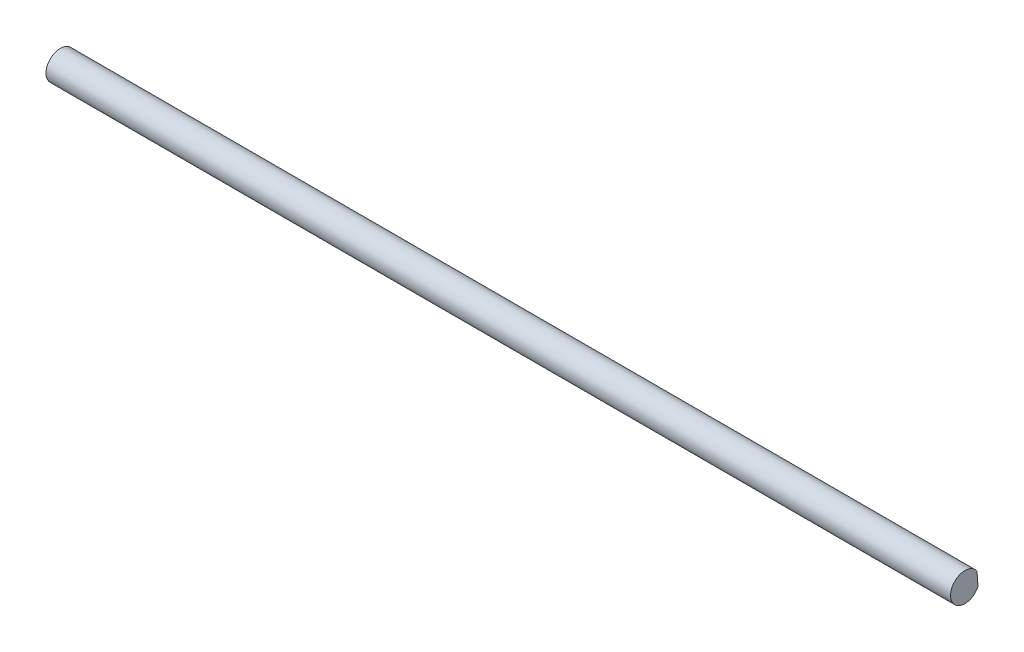
ISO-10303-21;
HEADER;
FILE_DESCRIPTION(('STEP AP214'),'2;1');
FILE_NAME('part.step','',(''),(''),'','','');
FILE_SCHEMA(('AUTOMOTIVE_DESIGN { 1 0 10303 214 1 1 1 1 }'));
ENDSEC;
DATA;
#1=APPLICATION_CONTEXT('core data for automotive mechanical design processes');
#2=APPLICATION_PROTOCOL_DEFINITION('international standard','automotive_design',2000,#1);
#3=PRODUCT_CONTEXT('',#1,'mechanical');
#4=PRODUCT('Part','Part','',(#3));
#5=PRODUCT_RELATED_PRODUCT_CATEGORY('part','',(#4));
#6=PRODUCT_DEFINITION_FORMATION('','',#4);
#7=PRODUCT_DEFINITION_CONTEXT('part definition',#1,'design');
#8=PRODUCT_DEFINITION('design','',#6,#7);
#9=PRODUCT_DEFINITION_SHAPE('','',#8);
#10=(LENGTH_UNIT() NAMED_UNIT(*) SI_UNIT(.MILLI.,.METRE.));
#11=(NAMED_UNIT(*) PLANE_ANGLE_UNIT() SI_UNIT($,.RADIAN.));
#12=(NAMED_UNIT(*) SI_UNIT($,.STERADIAN.) SOLID_ANGLE_UNIT());
#13=UNCERTAINTY_MEASURE_WITH_UNIT(LENGTH_MEASURE(1.E-05),#10,'distance_accuracy_value','');
#14=(GEOMETRIC_REPRESENTATION_CONTEXT(3) GLOBAL_UNCERTAINTY_ASSIGNED_CONTEXT((#13)) GLOBAL_UNIT_ASSIGNED_CONTEXT((#10,
#11,#12)) REPRESENTATION_CONTEXT('',''));
#15=CARTESIAN_POINT('',(0.,0.,0.));
#16=DIRECTION('',(0.,0.,1.));
#17=DIRECTION('',(1.,0.,0.));
#18=AXIS2_PLACEMENT_3D('',#15,#16,#17);
#19=CARTESIAN_POINT('',(200.,0.,0.));
#20=DIRECTION('',(-1.,0.,0.));
#21=DIRECTION('',(0.,0.,1.));
#22=AXIS2_PLACEMENT_3D('',#19,#20,#21);
#23=CYLINDRICAL_SURFACE('',#22,3.175);
#24=CARTESIAN_POINT('',(0.,0.,0.));
#25=DIRECTION('',(1.,0.,0.));
#26=DIRECTION('',(0.,0.,-1.));
#27=AXIS2_PLACEMENT_3D('',#24,#25,#26);
#28=CIRCLE('',#27,3.175);
#29=CARTESIAN_POINT('',(0.,1.69744000555634,-2.68315531185522));
#30=VERTEX_POINT('',#29);
#31=CARTESIAN_POINT('',(0.,-1.31143848976245,-2.89149685933939));
#32=VERTEX_POINT('',#31);
#33=EDGE_CURVE('E67',#30,#32,#28,.T.);
#34=ORIENTED_EDGE('',*,*,#33,.T.);
#35=DIRECTION('',(-1.,0.,0.));
#36=VECTOR('',#35,1.);
#37=CARTESIAN_POINT('',(200.,-1.31143848976245,-2.89149685933939));
#38=LINE('',#37,#36);
#39=CARTESIAN_POINT('',(200.,-1.31143848976245,-2.89149685933939));
#40=VERTEX_POINT('',#39);
#41=EDGE_CURVE('E11',#40,#32,#38,.T.);
#42=ORIENTED_EDGE('',*,*,#41,.F.);
#43=CARTESIAN_POINT('',(200.,0.,0.));
#44=DIRECTION('',(1.,0.,0.));
#45=DIRECTION('',(0.,0.,-1.));
#46=AXIS2_PLACEMENT_3D('',#43,#44,#45);
#47=CIRCLE('',#46,3.175);
#48=CARTESIAN_POINT('',(200.,1.69744000555634,-2.68315531185522));
#49=VERTEX_POINT('',#48);
#50=EDGE_CURVE('E66',#49,#40,#47,.T.);
#51=ORIENTED_EDGE('',*,*,#50,.F.);
#52=DIRECTION('',(-1.,0.,0.));
#53=VECTOR('',#52,1.);
#54=CARTESIAN_POINT('',(200.,1.69744000555634,-2.68315531185522));
#55=LINE('',#54,#53);
#56=EDGE_CURVE('E44',#49,#30,#55,.T.);
#57=ORIENTED_EDGE('',*,*,#56,.T.);
#58=EDGE_LOOP('',(#34,#42,#51,#57));
#59=FACE_BOUND('',#58,.T.);
#60=ADVANCED_FACE('F36',(#59),#23,.T.);
#61=CARTESIAN_POINT('',(200.,-1.31143848976245,-2.89149685933939));
#62=DIRECTION('',(0.,-0.0690768639573883,0.997611340586008));
#63=DIRECTION('',(0.,-0.997611340586008,-0.0690768639573883));
#64=AXIS2_PLACEMENT_3D('',#61,#62,#63);
#65=PLANE('',#64);
#66=DIRECTION('',(0.,0.997611340586008,0.0690768639573883));
#67=VECTOR('',#66,1.);
#68=CARTESIAN_POINT('',(0.,-1.31143848976245,-2.89149685933939));
#69=LINE('',#68,#67);
#70=EDGE_CURVE('E59',#32,#30,#69,.T.);
#71=ORIENTED_EDGE('',*,*,#70,.T.);
#72=ORIENTED_EDGE('',*,*,#56,.F.);
#73=DIRECTION('',(0.,0.997611340586008,0.0690768639573883));
#74=VECTOR('',#73,1.);
#75=CARTESIAN_POINT('',(200.,-1.31143848976245,-2.89149685933939));
#76=LINE('',#75,#74);
#77=EDGE_CURVE('E51',#40,#49,#76,.T.);
#78=ORIENTED_EDGE('',*,*,#77,.F.);
#79=ORIENTED_EDGE('',*,*,#41,.T.);
#80=EDGE_LOOP('',(#71,#72,#78,#79));
#81=FACE_BOUND('',#80,.T.);
#82=ADVANCED_FACE('F62',(#81),#65,.F.);
#83=CARTESIAN_POINT('',(200.,0.,0.));
#84=DIRECTION('',(1.,0.,0.));
#85=DIRECTION('',(0.,0.,-1.));
#86=AXIS2_PLACEMENT_3D('',#83,#84,#85);
#87=PLANE('',#86);
#88=ORIENTED_EDGE('',*,*,#50,.T.);
#89=ORIENTED_EDGE('',*,*,#77,.T.);
#90=EDGE_LOOP('',(#88,#89));
#91=FACE_BOUND('',#90,.T.);
#92=ADVANCED_FACE('F74',(#91),#87,.T.);
#93=CARTESIAN_POINT('',(0.,0.,0.));
#94=DIRECTION('',(1.,0.,0.));
#95=DIRECTION('',(0.,0.,-1.));
#96=AXIS2_PLACEMENT_3D('',#93,#94,#95);
#97=PLANE('',#96);
#98=ORIENTED_EDGE('',*,*,#33,.F.);
#99=ORIENTED_EDGE('',*,*,#70,.F.);
#100=EDGE_LOOP('',(#98,#99));
#101=FACE_BOUND('',#100,.T.);
#102=ADVANCED_FACE('F70',(#101),#97,.F.);
#103=CLOSED_SHELL('',(#60,#82,#92,#102));
#104=MANIFOLD_SOLID_BREP('B2',#103);
#105=ADVANCED_BREP_SHAPE_REPRESENTATION('',(#18,#104),#14);
#106=SHAPE_DEFINITION_REPRESENTATION(#9,#105);
ENDSEC;
END-ISO-10303-21;
